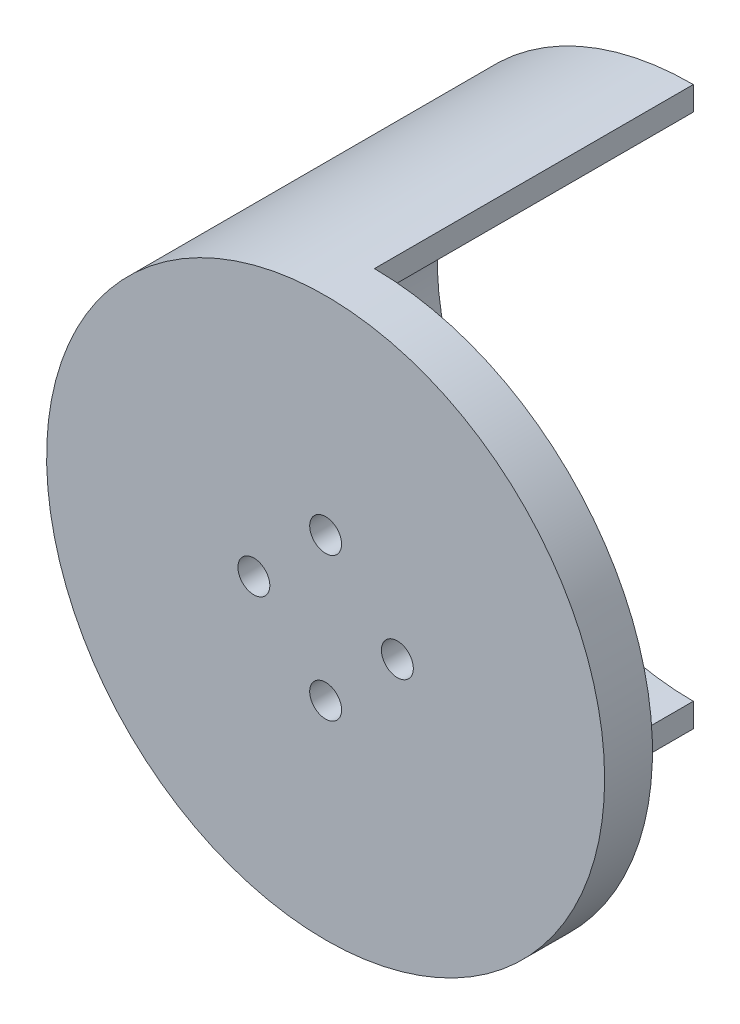
ISO-10303-21;
HEADER;
FILE_DESCRIPTION(('STEP AP214'),'2;1');
FILE_NAME('part.step','',(''),(''),'','','');
FILE_SCHEMA(('AUTOMOTIVE_DESIGN { 1 0 10303 214 1 1 1 1 }'));
ENDSEC;
DATA;
#1=APPLICATION_CONTEXT('core data for automotive mechanical design processes');
#2=APPLICATION_PROTOCOL_DEFINITION('international standard','automotive_design',2000,#1);
#3=PRODUCT_CONTEXT('',#1,'mechanical');
#4=PRODUCT('Part','Part','',(#3));
#5=PRODUCT_RELATED_PRODUCT_CATEGORY('part','',(#4));
#6=PRODUCT_DEFINITION_FORMATION('','',#4);
#7=PRODUCT_DEFINITION_CONTEXT('part definition',#1,'design');
#8=PRODUCT_DEFINITION('design','',#6,#7);
#9=PRODUCT_DEFINITION_SHAPE('','',#8);
#10=(LENGTH_UNIT() NAMED_UNIT(*) SI_UNIT(.MILLI.,.METRE.));
#11=(NAMED_UNIT(*) PLANE_ANGLE_UNIT() SI_UNIT($,.RADIAN.));
#12=(NAMED_UNIT(*) SI_UNIT($,.STERADIAN.) SOLID_ANGLE_UNIT());
#13=UNCERTAINTY_MEASURE_WITH_UNIT(LENGTH_MEASURE(1.E-05),#10,'distance_accuracy_value','');
#14=(GEOMETRIC_REPRESENTATION_CONTEXT(3) GLOBAL_UNCERTAINTY_ASSIGNED_CONTEXT((#13)) GLOBAL_UNIT_ASSIGNED_CONTEXT((#10,
#11,#12)) REPRESENTATION_CONTEXT('',''));
#15=CARTESIAN_POINT('',(0.,0.,0.));
#16=DIRECTION('',(0.,0.,1.));
#17=DIRECTION('',(1.,0.,0.));
#18=AXIS2_PLACEMENT_3D('',#15,#16,#17);
#19=CARTESIAN_POINT('',(0.,0.,-20.));
#20=DIRECTION('',(0.,0.,-1.));
#21=DIRECTION('',(1.,0.,0.));
#22=AXIS2_PLACEMENT_3D('',#19,#20,#21);
#23=PLANE('',#22);
#24=CARTESIAN_POINT('',(0.,0.,-20.));
#25=DIRECTION('',(0.,0.,1.));
#26=DIRECTION('',(1.,0.,0.));
#27=AXIS2_PLACEMENT_3D('',#24,#25,#26);
#28=CIRCLE('',#27,17.5);
#29=CARTESIAN_POINT('',(0.0613389301193247,17.4998925006885,-20.));
#30=VERTEX_POINT('',#29);
#31=CARTESIAN_POINT('',(0.0613389301193247,-17.4998925006885,-20.));
#32=VERTEX_POINT('',#31);
#33=EDGE_CURVE('E46',#30,#32,#28,.T.);
#34=ORIENTED_EDGE('',*,*,#33,.F.);
#35=DIRECTION('',(0.,1.,0.));
#36=VECTOR('',#35,1.);
#37=CARTESIAN_POINT('',(0.0613389301193247,0.,-20.));
#38=LINE('',#37,#36);
#39=CARTESIAN_POINT('',(0.0613389301193247,15.9998824225571,-20.));
#40=VERTEX_POINT('',#39);
#41=EDGE_CURVE('E146',#40,#30,#38,.T.);
#42=ORIENTED_EDGE('',*,*,#41,.F.);
#43=CARTESIAN_POINT('',(0.,0.,-20.));
#44=DIRECTION('',(0.,0.,1.));
#45=DIRECTION('',(1.,0.,0.));
#46=AXIS2_PLACEMENT_3D('',#43,#44,#45);
#47=CIRCLE('',#46,16.);
#48=CARTESIAN_POINT('',(0.0613389301193247,-15.9998824225571,-20.));
#49=VERTEX_POINT('',#48);
#50=EDGE_CURVE('E221',#40,#49,#47,.T.);
#51=ORIENTED_EDGE('',*,*,#50,.T.);
#52=EDGE_CURVE('E150',#32,#49,#38,.T.);
#53=ORIENTED_EDGE('',*,*,#52,.F.);
#54=EDGE_LOOP('',(#34,#42,#51,#53));
#55=FACE_BOUND('',#54,.T.);
#56=ADVANCED_FACE('F37',(#55),#23,.T.);
#57=CARTESIAN_POINT('',(0.,0.,-20.));
#58=DIRECTION('',(0.,0.,1.));
#59=DIRECTION('',(-1.,0.,0.));
#60=AXIS2_PLACEMENT_3D('',#57,#58,#59);
#61=CYLINDRICAL_SURFACE('',#60,17.5);
#62=DIRECTION('',(0.,0.,1.));
#63=VECTOR('',#62,1.);
#64=CARTESIAN_POINT('',(-9.79795897113271,-14.5,-20.));
#65=LINE('',#64,#63);
#66=CARTESIAN_POINT('',(-9.79795897113271,-14.5,-7.));
#67=VERTEX_POINT('',#66);
#68=CARTESIAN_POINT('',(-9.79795897113271,-14.5,0.));
#69=VERTEX_POINT('',#68);
#70=EDGE_CURVE('E127',#67,#69,#65,.T.);
#71=ORIENTED_EDGE('',*,*,#70,.F.);
#72=CARTESIAN_POINT('',(0.,0.,-7.));
#73=DIRECTION('',(0.,0.,1.));
#74=DIRECTION('',(0.,-1.,0.));
#75=AXIS2_PLACEMENT_3D('',#72,#73,#74);
#76=CIRCLE('',#75,17.5);
#77=CARTESIAN_POINT('',(-15.5643824162734,-8.,-7.));
#78=VERTEX_POINT('',#77);
#79=EDGE_CURVE('E121',#78,#67,#76,.T.);
#80=ORIENTED_EDGE('',*,*,#79,.F.);
#81=DIRECTION('',(0.,0.,1.));
#82=VECTOR('',#81,1.);
#83=CARTESIAN_POINT('',(-15.5643824162734,-8.,-20.));
#84=LINE('',#83,#82);
#85=CARTESIAN_POINT('',(-15.5643824162734,-8.,0.));
#86=VERTEX_POINT('',#85);
#87=EDGE_CURVE('E105',#86,#78,#84,.F.);
#88=ORIENTED_EDGE('',*,*,#87,.F.);
#89=CARTESIAN_POINT('',(0.,0.,0.));
#90=DIRECTION('',(0.,0.,-1.));
#91=DIRECTION('',(0.,1.,0.));
#92=AXIS2_PLACEMENT_3D('',#89,#90,#91);
#93=CIRCLE('',#92,17.5);
#94=EDGE_CURVE('E112',#69,#86,#93,.T.);
#95=ORIENTED_EDGE('',*,*,#94,.F.);
#96=EDGE_LOOP('',(#71,#80,#88,#95));
#97=FACE_BOUND('',#96,.T.);
#98=CARTESIAN_POINT('',(0.,0.,3.));
#99=DIRECTION('',(0.,0.,1.));
#100=DIRECTION('',(1.,0.,0.));
#101=AXIS2_PLACEMENT_3D('',#98,#99,#100);
#102=CIRCLE('',#101,17.5);
#103=CARTESIAN_POINT('',(17.5,0.,3.));
#104=VERTEX_POINT('',#103);
#105=EDGE_CURVE('E185',#104,#104,#102,.T.);
#106=ORIENTED_EDGE('',*,*,#105,.F.);
#107=EDGE_LOOP('',(#106));
#108=FACE_BOUND('',#107,.T.);
#109=CARTESIAN_POINT('',(-17.5,0.,-12.));
#110=CARTESIAN_POINT('',(-17.4999967323586,-0.274887255943128,-11.9999951510951));
#111=CARTESIAN_POINT('',(-17.4934604350511,-0.549824369681454,-11.9772555275597));
#112=CARTESIAN_POINT('',(-17.4680226486276,-1.09172997799247,-11.8870893247442));
#113=CARTESIAN_POINT('',(-17.4491164802521,-1.35869541707404,-11.8196458348148));
#114=CARTESIAN_POINT('',(-17.4010172837268,-1.87676075184468,-11.6424799039587));
#115=CARTESIAN_POINT('',(-17.3718386026585,-2.12788220212056,-11.5328164096201));
#116=CARTESIAN_POINT('',(-17.3062494579136,-2.60817190282318,-11.2745550213041));
#117=CARTESIAN_POINT('',(-17.2698382377007,-2.83733785294541,-11.1259530537741));
#118=CARTESIAN_POINT('',(-17.1926183656394,-3.27323611714736,-10.7899124733177));
#119=CARTESIAN_POINT('',(-17.1517260486293,-3.47930930595233,-10.6016381153618));
#120=CARTESIAN_POINT('',(-17.0706683728915,-3.85742839481088,-10.1933806421558));
#121=CARTESIAN_POINT('',(-17.0305031239854,-4.02946919269461,-9.97339278091952));
#122=CARTESIAN_POINT('',(-16.9545753718829,-4.3379947501607,-9.50251604302262));
#123=CARTESIAN_POINT('',(-16.9189175626436,-4.47369552758351,-9.25109503733746));
#124=CARTESIAN_POINT('',(-16.8572835960235,-4.7006292638497,-8.72781997062347));
#125=CARTESIAN_POINT('',(-16.8313053561473,-4.79187178889368,-8.4559703198242));
#126=CARTESIAN_POINT('',(-16.7928402048755,-4.92496082534618,-7.90691309208477));
#127=CARTESIAN_POINT('',(-16.7800244641586,-4.9680138300687,-7.63002159307529));
#128=CARTESIAN_POINT('',(-16.7683552051415,-5.00726669473215,-7.07267212888988));
#129=CARTESIAN_POINT('',(-16.769498653032,-5.00347673524998,-6.79221495189356));
#130=CARTESIAN_POINT('',(-16.7853258599179,-4.95010336906261,-6.24532847133277));
#131=CARTESIAN_POINT('',(-16.7995695662338,-4.90200814317313,-5.97873912196361));
#132=CARTESIAN_POINT('',(-16.8392837083571,-4.76378465210904,-5.45758195085061));
#133=CARTESIAN_POINT('',(-16.8647551590827,-4.67365258702332,-5.20301521818008));
#134=CARTESIAN_POINT('',(-16.9244215882327,-4.45276702845641,-4.70938438894628));
#135=CARTESIAN_POINT('',(-16.95872291023,-4.32151377932501,-4.47055731900275));
#136=CARTESIAN_POINT('',(-17.0321304219627,-4.02245947919414,-4.01780859695957));
#137=CARTESIAN_POINT('',(-17.0712376805236,-3.85465029183281,-3.80389250566084));
#138=CARTESIAN_POINT('',(-17.151656266434,-3.47975999182637,-3.39856906098605));
#139=CARTESIAN_POINT('',(-17.1929951143159,-3.27143718711355,-3.20831381008246));
#140=CARTESIAN_POINT('',(-17.2719061804519,-2.82533070596534,-2.86518499089877));
#141=CARTESIAN_POINT('',(-17.3094782034438,-2.58754550370467,-2.71231335989559));
#142=CARTESIAN_POINT('',(-17.3769132016394,-2.08730768272867,-2.44767816306506));
#143=CARTESIAN_POINT('',(-17.4067318874312,-1.82472454452503,-2.33614928298958));
#144=CARTESIAN_POINT('',(-17.4549812871891,-1.28348307491866,-2.15916527145791));
#145=CARTESIAN_POINT('',(-17.4734148714063,-1.00482881452536,-2.09369852688682));
#146=CARTESIAN_POINT('',(-17.4963718628669,-0.449165971610882,-2.01256678572638));
#147=CARTESIAN_POINT('',(-17.501331821265,-0.172403367151275,-1.99533826156744));
#148=CARTESIAN_POINT('',(-17.4980521176773,0.380066317013954,-2.00681816575261));
#149=CARTESIAN_POINT('',(-17.4898140395157,0.655773519392766,-2.03552108211481));
#150=CARTESIAN_POINT('',(-17.4613481671301,1.19254658357578,-2.13677611079064));
#151=CARTESIAN_POINT('',(-17.4413653254419,1.4537955293371,-2.20843295330849));
#152=CARTESIAN_POINT('',(-17.3916999685472,1.9605217155141,-2.39250125496168));
#153=CARTESIAN_POINT('',(-17.3620163316471,2.20599712812179,-2.50491742722334));
#154=CARTESIAN_POINT('',(-17.2952490292284,2.68010421280007,-2.77005834161282));
#155=CARTESIAN_POINT('',(-17.2580190794575,2.90825621635021,-2.92360299706335));
#156=CARTESIAN_POINT('',(-17.180448677462,3.33609632014868,-3.26563126487772));
#157=CARTESIAN_POINT('',(-17.1401075188813,3.53577792710762,-3.45412282516136));
#158=CARTESIAN_POINT('',(-17.0592154907323,3.90776607085015,-3.86802335512367));
#159=CARTESIAN_POINT('',(-17.0187009214433,4.07896356851775,-4.09443818889788));
#160=CARTESIAN_POINT('',(-16.9434723683839,4.38098829016899,-4.57365647156141));
#161=CARTESIAN_POINT('',(-16.9087581828186,4.51181691871704,-4.82645900192717));
#162=CARTESIAN_POINT('',(-16.8494662810178,4.72843635295665,-5.35022802743902));
#163=CARTESIAN_POINT('',(-16.8248350005383,4.8144658309902,-5.62108940874769));
#164=CARTESIAN_POINT('',(-16.7885614169356,4.93948625169787,-6.17427483893332));
#165=CARTESIAN_POINT('',(-16.7769151780959,4.9784914475439,-6.4565953876774));
#166=CARTESIAN_POINT('',(-16.7682925774812,5.00745060616827,-7.0132400823757));
#167=CARTESIAN_POINT('',(-16.7707790176036,4.99920069109391,-7.28746376148121));
#168=CARTESIAN_POINT('',(-16.7888649275624,4.93811777392153,-7.83043682673311));
#169=CARTESIAN_POINT('',(-16.8044639598361,4.88528625949613,-8.09918639524222));
#170=CARTESIAN_POINT('',(-16.8466744296963,4.73764922042289,-8.6209459278904));
#171=CARTESIAN_POINT('',(-16.8731719264076,4.64327729466074,-8.87408846751958));
#172=CARTESIAN_POINT('',(-16.9341825708695,4.41557373253792,-9.36114683623883));
#173=CARTESIAN_POINT('',(-16.9686971370099,4.28223520107836,-9.59505925318534));
#174=CARTESIAN_POINT('',(-17.0432917237999,3.97516366337116,-10.045458804511));
#175=CARTESIAN_POINT('',(-17.0835190794904,3.80023069306842,-10.2611034783543));
#176=CARTESIAN_POINT('',(-17.164246127292,3.41714960094825,-10.6605597395252));
#177=CARTESIAN_POINT('',(-17.2047458854255,3.20899312682136,-10.8443632977772));
#178=CARTESIAN_POINT('',(-17.282698989313,2.75893580216352,-11.1795929608164));
#179=CARTESIAN_POINT('',(-17.3200475259364,2.51630625589946,-11.330067468174));
#180=CARTESIAN_POINT('',(-17.3862848944483,2.00812632411665,-11.5878644625551));
#181=CARTESIAN_POINT('',(-17.4151783467569,1.74258856028685,-11.6952105298327));
#182=CARTESIAN_POINT('',(-17.4581836181329,1.23229078833759,-11.8521188784886));
#183=CARTESIAN_POINT('',(-17.473742109052,0.989407519060976,-11.9074338417114));
#184=CARTESIAN_POINT('',(-17.4946510963036,0.497695921965917,-11.9813741431054));
#185=CARTESIAN_POINT('',(-17.5000029583499,0.248868394040229,-12.0000043899422));
#186=CARTESIAN_POINT('',(-17.5,0.,-12.));
#187=B_SPLINE_CURVE_WITH_KNOTS('',3,(#109,#110,#111,#112,#113,#114,#115,#116,#117,#118,#119,
#120,#121,#122,#123,#124,#125,#126,#127,#128,#129,#130,#131,#132,#133,#134,#135,#136,#137,#138,
#139,#140,#141,#142,#143,#144,#145,#146,#147,#148,#149,#150,#151,#152,#153,#154,#155,#156,#157,
#158,#159,#160,#161,#162,#163,#164,#165,#166,#167,#168,#169,#170,#171,#172,#173,#174,#175,#176,
#177,#178,#179,#180,#181,#182,#183,#184,#185,#186),.UNSPECIFIED.,.T.,.F.,(4,2,2,2,2,2,2,2,2,2,2,
2,2,2,2,2,2,2,2,2,2,2,2,2,2,2,2,2,2,2,2,2,2,2,2,2,2,2,4),(0.,0.82374828135586,1.64780834948795,
2.47072203223836,3.29372183858789,4.13619528826953,4.97879494684283,5.83832688250143,
6.69767378862023,7.53498774656874,8.37211973078082,9.18211964575844,9.99219279470076,
10.8125200823279,11.6330301394812,12.4844625151101,13.3359390039338,14.1921775276588,
15.0482001004129,15.8761364425026,16.7039734359138,17.5151285120356,18.3263774144358,
19.1551881336589,19.9841875797423,20.840302622156,21.6963878741801,22.5478643342011,
23.399082644741,24.2181670405214,25.0372241048183,25.8479274074504,26.6587742501082,
27.4966914224279,28.3348195778806,29.1944494744229,30.053608731021,30.7994867011175,
31.5452648608618),.UNSPECIFIED.);
#188=CARTESIAN_POINT('',(-17.5,0.,-12.));
#189=VERTEX_POINT('',#188);
#190=EDGE_CURVE('E178',#189,#189,#187,.T.);
#191=ORIENTED_EDGE('',*,*,#190,.F.);
#192=EDGE_LOOP('',(#191));
#193=FACE_BOUND('',#192,.T.);
#194=DIRECTION('',(0.,0.,1.));
#195=VECTOR('',#194,1.);
#196=CARTESIAN_POINT('',(0.0613389301193247,-17.4998925006885,-30.));
#197=LINE('',#196,#195);
#198=CARTESIAN_POINT('',(0.0613389301193247,-17.4998925006885,0.));
#199=VERTEX_POINT('',#198);
#200=EDGE_CURVE('E138',#32,#199,#197,.T.);
#201=ORIENTED_EDGE('',*,*,#200,.T.);
#202=CARTESIAN_POINT('',(0.,0.,0.));
#203=DIRECTION('',(0.,0.,1.));
#204=DIRECTION('',(1.,0.,0.));
#205=AXIS2_PLACEMENT_3D('',#202,#203,#204);
#206=CIRCLE('',#205,17.5);
#207=CARTESIAN_POINT('',(0.0613389301193247,17.4998925006885,0.));
#208=VERTEX_POINT('',#207);
#209=EDGE_CURVE('E141',#199,#208,#206,.T.);
#210=ORIENTED_EDGE('',*,*,#209,.T.);
#211=DIRECTION('',(0.,0.,1.));
#212=VECTOR('',#211,1.);
#213=CARTESIAN_POINT('',(0.0613389301193247,17.4998925006885,-30.));
#214=LINE('',#213,#212);
#215=EDGE_CURVE('E135',#30,#208,#214,.T.);
#216=ORIENTED_EDGE('',*,*,#215,.F.);
#217=ORIENTED_EDGE('',*,*,#33,.T.);
#218=EDGE_LOOP('',(#201,#210,#216,#217));
#219=FACE_BOUND('',#218,.T.);
#220=ADVANCED_FACE('F39',(#97,#108,#193,#219),#61,.T.);
#221=CARTESIAN_POINT('',(0.,0.,-20.));
#222=DIRECTION('',(0.,0.,1.));
#223=DIRECTION('',(-1.,0.,0.));
#224=AXIS2_PLACEMENT_3D('',#221,#222,#223);
#225=CYLINDRICAL_SURFACE('',#224,16.);
#226=DIRECTION('',(0.,0.,1.));
#227=VECTOR('',#226,1.);
#228=CARTESIAN_POINT('',(-6.76387462923433,-14.5,-20.));
#229=LINE('',#228,#227);
#230=CARTESIAN_POINT('',(-6.76387462923433,-14.5,-7.));
#231=VERTEX_POINT('',#230);
#232=CARTESIAN_POINT('',(-6.76387462923433,-14.5,0.));
#233=VERTEX_POINT('',#232);
#234=EDGE_CURVE('E124',#231,#233,#229,.T.);
#235=ORIENTED_EDGE('',*,*,#234,.T.);
#236=CARTESIAN_POINT('',(0.,0.,0.));
#237=DIRECTION('',(0.,0.,1.));
#238=DIRECTION('',(1.,0.,0.));
#239=AXIS2_PLACEMENT_3D('',#236,#237,#238);
#240=CIRCLE('',#239,16.);
#241=CARTESIAN_POINT('',(0.0613389301193247,-15.9998824225571,0.));
#242=VERTEX_POINT('',#241);
#243=EDGE_CURVE('E224',#233,#242,#240,.T.);
#244=ORIENTED_EDGE('',*,*,#243,.T.);
#245=DIRECTION('',(0.,0.,1.));
#246=VECTOR('',#245,1.);
#247=CARTESIAN_POINT('',(0.0613389301193247,-15.9998824225571,-20.));
#248=LINE('',#247,#246);
#249=EDGE_CURVE('E149',#49,#242,#248,.T.);
#250=ORIENTED_EDGE('',*,*,#249,.F.);
#251=ORIENTED_EDGE('',*,*,#50,.F.);
#252=DIRECTION('',(0.,0.,1.));
#253=VECTOR('',#252,1.);
#254=CARTESIAN_POINT('',(0.0613389301193247,15.9998824225571,-20.));
#255=LINE('',#254,#253);
#256=CARTESIAN_POINT('',(0.0613389301193247,15.9998824225571,0.));
#257=VERTEX_POINT('',#256);
#258=EDGE_CURVE('E144',#257,#40,#255,.F.);
#259=ORIENTED_EDGE('',*,*,#258,.F.);
#260=CARTESIAN_POINT('',(-13.856406460551,-8.,0.));
#261=VERTEX_POINT('',#260);
#262=EDGE_CURVE('E222',#257,#261,#240,.T.);
#263=ORIENTED_EDGE('',*,*,#262,.T.);
#264=DIRECTION('',(0.,0.,1.));
#265=VECTOR('',#264,1.);
#266=CARTESIAN_POINT('',(-13.856406460551,-8.,-20.));
#267=LINE('',#266,#265);
#268=CARTESIAN_POINT('',(-13.856406460551,-8.,-7.));
#269=VERTEX_POINT('',#268);
#270=EDGE_CURVE('E108',#261,#269,#267,.F.);
#271=ORIENTED_EDGE('',*,*,#270,.T.);
#272=CARTESIAN_POINT('',(0.,0.,-7.));
#273=DIRECTION('',(0.,0.,1.));
#274=DIRECTION('',(0.,-1.,0.));
#275=AXIS2_PLACEMENT_3D('',#272,#273,#274);
#276=CIRCLE('',#275,16.);
#277=EDGE_CURVE('E11',#269,#231,#276,.T.);
#278=ORIENTED_EDGE('',*,*,#277,.T.);
#279=EDGE_LOOP('',(#235,#244,#250,#251,#259,#263,#271,#278));
#280=FACE_BOUND('',#279,.T.);
#281=CARTESIAN_POINT('',(-16.,0.,-12.));
#282=CARTESIAN_POINT('',(-15.9999986351195,-0.273756740698179,-11.9999982136497));
#283=CARTESIAN_POINT('',(-15.9929077993933,-0.54753221001141,-11.9774430922222));
#284=CARTESIAN_POINT('',(-15.9653157635526,-1.08707683835382,-11.888055033843));
#285=CARTESIAN_POINT('',(-15.9448115279957,-1.35284417090373,-11.8212120745424));
#286=CARTESIAN_POINT('',(-15.892632627915,-1.86851417460312,-11.6457225152172));
#287=CARTESIAN_POINT('',(-15.860975259956,-2.11844070794284,-11.5371406213887));
#288=CARTESIAN_POINT('',(-15.7897587664487,-2.59653920938621,-11.2815307292862));
#289=CARTESIAN_POINT('',(-15.7501983960149,-2.82470774178094,-11.1344966728757));
#290=CARTESIAN_POINT('',(-15.6660085495921,-3.25986133980768,-10.8013760319326));
#291=CARTESIAN_POINT('',(-15.621268637007,-3.46608011262119,-10.6143164597633));
#292=CARTESIAN_POINT('',(-15.5324018550409,-3.84478952815342,-10.2085264303382));
#293=CARTESIAN_POINT('',(-15.4882751012093,-4.01727389161514,-9.98979008999343));
#294=CARTESIAN_POINT('',(-15.4044457876484,-4.32777345930637,-9.52022174479268));
#295=CARTESIAN_POINT('',(-15.3648795310221,-4.46483136593109,-9.2687300899923));
#296=CARTESIAN_POINT('',(-15.2963120709366,-4.69438964299238,-8.74483074017737));
#297=CARTESIAN_POINT('',(-15.2673080849026,-4.78690175085853,-8.47242857685659));
#298=CARTESIAN_POINT('',(-15.224304279618,-4.92193839721856,-7.92308769016631));
#299=CARTESIAN_POINT('',(-15.2098789171452,-4.96588440031618,-7.64653262543181));
#300=CARTESIAN_POINT('',(-15.1964022056731,-5.00698220147793,-7.0896275243652));
#301=CARTESIAN_POINT('',(-15.1973467694717,-5.00414643984172,-6.80927851673902));
#302=CARTESIAN_POINT('',(-15.2141275626545,-4.95287298929817,-6.26450215888892));
#303=CARTESIAN_POINT('',(-15.2293736684469,-4.90624231472934,-5.99988349644806));
#304=CARTESIAN_POINT('',(-15.272081024701,-4.77163253417961,-5.48243137375097));
#305=CARTESIAN_POINT('',(-15.2995435733467,-4.68364903377187,-5.2295991691417));
#306=CARTESIAN_POINT('',(-15.3640417609541,-4.46755498726522,-4.73859222230161));
#307=CARTESIAN_POINT('',(-15.4012113865356,-4.33887702648707,-4.5006855572407));
#308=CARTESIAN_POINT('',(-15.4808742631002,-4.04544082951013,-4.04924892847488));
#309=CARTESIAN_POINT('',(-15.523368895754,-3.88067322086205,-3.83572531898279));
#310=CARTESIAN_POINT('',(-15.6112611120491,-3.51086781672958,-3.42890022633452));
#311=CARTESIAN_POINT('',(-15.6567027842357,-3.30433828237156,-3.23696176888193));
#312=CARTESIAN_POINT('',(-15.7436628303753,-2.86145763238183,-2.89011242568063));
#313=CARTESIAN_POINT('',(-15.7851809135328,-2.62510430939601,-2.73520428312299));
#314=CARTESIAN_POINT('',(-15.8600517956098,-2.1266584418619,-2.46588924559508));
#315=CARTESIAN_POINT('',(-15.8933384259289,-1.86437962767714,-2.35180745814418));
#316=CARTESIAN_POINT('',(-15.9475182331416,-1.32307191113056,-2.16978799659369));
#317=CARTESIAN_POINT('',(-15.9684151730059,-1.04404812289843,-2.10183631104641));
#318=CARTESIAN_POINT('',(-15.9948555758007,-0.488740629161386,-2.0163278296841));
#319=CARTESIAN_POINT('',(-16.0009609158175,-0.212767395155375,-1.99692582562591));
#320=CARTESIAN_POINT('',(-15.9987919892393,0.338521222930343,-2.00386490654933));
#321=CARTESIAN_POINT('',(-15.9905198232454,0.613836697226034,-2.03019930929045));
#322=CARTESIAN_POINT('',(-15.9608945507905,1.14887733190339,-2.12638237042555));
#323=CARTESIAN_POINT('',(-15.9398717244275,1.40881991368375,-2.19513307044995));
#324=CARTESIAN_POINT('',(-15.8872048551716,1.91340771544551,-2.37285740946687));
#325=CARTESIAN_POINT('',(-15.8555595005737,2.15805104179623,-2.48183601610005));
#326=CARTESIAN_POINT('',(-15.783941710377,2.63172962668875,-2.73989286619475));
#327=CARTESIAN_POINT('',(-15.7437850727067,2.86023895915116,-2.88988394998725));
#328=CARTESIAN_POINT('',(-15.6597364001372,3.28946340384104,-3.2246128404697));
#329=CARTESIAN_POINT('',(-15.6158433539155,3.4901709521758,-3.40936007097857));
#330=CARTESIAN_POINT('',(-15.5270797953257,3.86634985167607,-3.8170355602084));
#331=CARTESIAN_POINT('',(-15.4822394682577,4.04050609358125,-4.0411866549569));
#332=CARTESIAN_POINT('',(-15.3984778838242,4.34885000980606,-4.5165064655071));
#333=CARTESIAN_POINT('',(-15.3595565324524,4.48303831893718,-4.76767475210794));
#334=CARTESIAN_POINT('',(-15.2924712932348,4.70680333922169,-5.28938069148191));
#335=CARTESIAN_POINT('',(-15.264265854275,4.7965527822405,-5.55983859774289));
#336=CARTESIAN_POINT('',(-15.2220468337724,4.9289157727236,-6.11308997299448));
#337=CARTESIAN_POINT('',(-15.2080278520491,4.97154725655978,-6.39587870537413));
#338=CARTESIAN_POINT('',(-15.1963317085551,5.00717624632502,-6.95201635032171));
#339=CARTESIAN_POINT('',(-15.1979441840057,5.00233118486543,-7.22521381538967));
#340=CARTESIAN_POINT('',(-15.2156036150361,4.94835272515335,-7.76669833976775));
#341=CARTESIAN_POINT('',(-15.2316498972642,4.89922139290048,-8.03498562754694));
#342=CARTESIAN_POINT('',(-15.2758725673356,4.7595091965447,-8.55517615836757));
#343=CARTESIAN_POINT('',(-15.3038679276103,4.66954569624033,-8.80726176437344));
#344=CARTESIAN_POINT('',(-15.3687881701826,4.45120909339998,-9.29296165413602));
#345=CARTESIAN_POINT('',(-15.4057148685869,4.32282817776947,-9.52657216831362));
#346=CARTESIAN_POINT('',(-15.4861394813401,4.02542700053973,-9.97858388175925));
#347=CARTESIAN_POINT('',(-15.5298379569183,3.85501334096529,-10.196032518001));
#348=CARTESIAN_POINT('',(-15.6179599528484,3.4808359856192,-10.599945312448));
#349=CARTESIAN_POINT('',(-15.6623836642662,3.27706336937756,-10.7864011559642));
#350=CARTESIAN_POINT('',(-15.7486908780989,2.83394665129338,-11.1291301534517));
#351=CARTESIAN_POINT('',(-15.7904440692269,2.59365829794953,-11.2842189457998));
#352=CARTESIAN_POINT('',(-15.8650707718751,2.0891165520546,-11.5515956605578));
#353=CARTESIAN_POINT('',(-15.8979477726329,1.82487263118179,-11.6639004085673));
#354=CARTESIAN_POINT('',(-15.9488260293388,1.30299054149591,-11.8343654704339));
#355=CARTESIAN_POINT('',(-15.9678496322456,1.04668134845019,-11.8962994692214));
#356=CARTESIAN_POINT('',(-15.9934360136194,0.526919581760988,-11.9791134398709));
#357=CARTESIAN_POINT('',(-16.0000013135858,0.263468464558692,-12.000001719216));
#358=CARTESIAN_POINT('',(-16.,0.,-12.));
#359=B_SPLINE_CURVE_WITH_KNOTS('',3,(#281,#282,#283,#284,#285,#286,#287,#288,#289,#290,#291,
#292,#293,#294,#295,#296,#297,#298,#299,#300,#301,#302,#303,#304,#305,#306,#307,#308,#309,#310,
#311,#312,#313,#314,#315,#316,#317,#318,#319,#320,#321,#322,#323,#324,#325,#326,#327,#328,#329,
#330,#331,#332,#333,#334,#335,#336,#337,#338,#339,#340,#341,#342,#343,#344,#345,#346,#347,#348,
#349,#350,#351,#352,#353,#354,#355,#356,#357,#358),.UNSPECIFIED.,.T.,.F.,(4,2,2,2,2,2,2,2,2,2,2,
2,2,2,2,2,2,2,2,2,2,2,2,2,2,2,2,2,2,2,2,2,2,2,2,2,2,2,4),(0.,0.820301797730039,1.64078929339626,
2.46000991680974,3.27935968623356,4.12151288780633,4.96382269725105,5.82695084991452,
6.68985145121463,7.52676600672195,8.36345801183908,9.16707669695194,9.97078079925601,
10.7862257089153,11.6018826405078,12.4546698912775,13.3075202966256,14.1670184276843,
15.0262553798756,15.852302742023,16.678229426068,17.4836250690084,18.2891202014735,
19.1142529896272,19.9396098284639,20.7976711486191,21.655718839442,22.5104046302277,
23.3647649559871,24.1804881394266,24.9961732705188,25.7999165363422,26.6038233736823,
27.4391805607299,28.274761495409,29.1376267255319,30.0001522671289,30.789785466537,
31.5792588309973),.UNSPECIFIED.);
#360=CARTESIAN_POINT('',(-16.,0.,-12.));
#361=VERTEX_POINT('',#360);
#362=EDGE_CURVE('E177',#361,#361,#359,.T.);
#363=ORIENTED_EDGE('',*,*,#362,.T.);
#364=EDGE_LOOP('',(#363));
#365=FACE_BOUND('',#364,.T.);
#366=ADVANCED_FACE('F205',(#280,#365),#225,.F.);
#367=CARTESIAN_POINT('',(0.,0.,0.));
#368=DIRECTION('',(0.,0.,-1.));
#369=DIRECTION('',(1.,0.,0.));
#370=AXIS2_PLACEMENT_3D('',#367,#368,#369);
#371=PLANE('',#370);
#372=ORIENTED_EDGE('',*,*,#262,.F.);
#373=DIRECTION('',(0.,-1.,0.));
#374=VECTOR('',#373,1.);
#375=CARTESIAN_POINT('',(0.0613389301193247,-17.4998925006885,0.));
#376=LINE('',#375,#374);
#377=EDGE_CURVE('E133',#208,#257,#376,.T.);
#378=ORIENTED_EDGE('',*,*,#377,.F.);
#379=ORIENTED_EDGE('',*,*,#209,.F.);
#380=EDGE_CURVE('E120',#242,#199,#376,.T.);
#381=ORIENTED_EDGE('',*,*,#380,.F.);
#382=ORIENTED_EDGE('',*,*,#243,.F.);
#383=DIRECTION('',(1.,0.,0.));
#384=VECTOR('',#383,1.);
#385=CARTESIAN_POINT('',(-30.,-14.5,0.));
#386=LINE('',#385,#384);
#387=EDGE_CURVE('E116',#69,#233,#386,.T.);
#388=ORIENTED_EDGE('',*,*,#387,.F.);
#389=ORIENTED_EDGE('',*,*,#94,.T.);
#390=DIRECTION('',(1.,0.,0.));
#391=VECTOR('',#390,1.);
#392=CARTESIAN_POINT('',(-30.,-8.,0.));
#393=LINE('',#392,#391);
#394=EDGE_CURVE('E61',#86,#261,#393,.T.);
#395=ORIENTED_EDGE('',*,*,#394,.T.);
#396=EDGE_LOOP('',(#372,#378,#379,#381,#382,#388,#389,#395));
#397=FACE_BOUND('',#396,.T.);
#398=CARTESIAN_POINT('',(0.,-4.5,0.));
#399=DIRECTION('',(0.,0.,1.));
#400=DIRECTION('',(1.,0.,0.));
#401=AXIS2_PLACEMENT_3D('',#398,#399,#400);
#402=CIRCLE('',#401,1.);
#403=CARTESIAN_POINT('',(1.00000000000005,-4.5,0.));
#404=VERTEX_POINT('',#403);
#405=EDGE_CURVE('E156',#404,#404,#402,.T.);
#406=ORIENTED_EDGE('',*,*,#405,.T.);
#407=EDGE_LOOP('',(#406));
#408=FACE_BOUND('',#407,.T.);
#409=CARTESIAN_POINT('',(0.,4.5,0.));
#410=DIRECTION('',(0.,0.,1.));
#411=DIRECTION('',(1.,0.,0.));
#412=AXIS2_PLACEMENT_3D('',#409,#410,#411);
#413=CIRCLE('',#412,1.);
#414=CARTESIAN_POINT('',(0.999999999999985,4.5,0.));
#415=VERTEX_POINT('',#414);
#416=EDGE_CURVE('E171',#415,#415,#413,.T.);
#417=ORIENTED_EDGE('',*,*,#416,.T.);
#418=EDGE_LOOP('',(#417));
#419=FACE_BOUND('',#418,.T.);
#420=CARTESIAN_POINT('',(4.5,0.,0.));
#421=DIRECTION('',(0.,0.,1.));
#422=DIRECTION('',(1.,0.,0.));
#423=AXIS2_PLACEMENT_3D('',#420,#421,#422);
#424=CIRCLE('',#423,1.);
#425=CARTESIAN_POINT('',(5.5,0.,0.));
#426=VERTEX_POINT('',#425);
#427=EDGE_CURVE('E174',#426,#426,#424,.T.);
#428=ORIENTED_EDGE('',*,*,#427,.T.);
#429=EDGE_LOOP('',(#428));
#430=FACE_BOUND('',#429,.T.);
#431=CARTESIAN_POINT('',(-4.5,0.,0.));
#432=DIRECTION('',(0.,0.,1.));
#433=DIRECTION('',(1.,0.,0.));
#434=AXIS2_PLACEMENT_3D('',#431,#432,#433);
#435=CIRCLE('',#434,1.);
#436=CARTESIAN_POINT('',(-3.5,0.,0.));
#437=VERTEX_POINT('',#436);
#438=EDGE_CURVE('E168',#437,#437,#435,.T.);
#439=ORIENTED_EDGE('',*,*,#438,.T.);
#440=EDGE_LOOP('',(#439));
#441=FACE_BOUND('',#440,.T.);
#442=ADVANCED_FACE('F113',(#397,#408,#419,#430,#441),#371,.T.);
#443=CARTESIAN_POINT('',(0.,0.,3.));
#444=DIRECTION('',(0.,0.,-1.));
#445=DIRECTION('',(1.,0.,0.));
#446=AXIS2_PLACEMENT_3D('',#443,#444,#445);
#447=PLANE('',#446);
#448=CARTESIAN_POINT('',(4.5,0.,3.));
#449=DIRECTION('',(0.,0.,-1.));
#450=DIRECTION('',(-1.,0.,0.));
#451=AXIS2_PLACEMENT_3D('',#448,#449,#450);
#452=CIRCLE('',#451,1.);
#453=CARTESIAN_POINT('',(3.5,0.,3.));
#454=VERTEX_POINT('',#453);
#455=EDGE_CURVE('E153',#454,#454,#452,.T.);
#456=ORIENTED_EDGE('',*,*,#455,.T.);
#457=EDGE_LOOP('',(#456));
#458=FACE_BOUND('',#457,.T.);
#459=CARTESIAN_POINT('',(0.,4.5,3.));
#460=DIRECTION('',(0.,0.,-1.));
#461=DIRECTION('',(-1.,0.,0.));
#462=AXIS2_PLACEMENT_3D('',#459,#460,#461);
#463=CIRCLE('',#462,1.);
#464=CARTESIAN_POINT('',(-1.00000000000002,4.5,3.));
#465=VERTEX_POINT('',#464);
#466=EDGE_CURVE('E157',#465,#465,#463,.T.);
#467=ORIENTED_EDGE('',*,*,#466,.T.);
#468=EDGE_LOOP('',(#467));
#469=FACE_BOUND('',#468,.T.);
#470=CARTESIAN_POINT('',(-4.5,0.,3.));
#471=DIRECTION('',(0.,0.,-1.));
#472=DIRECTION('',(-1.,0.,0.));
#473=AXIS2_PLACEMENT_3D('',#470,#471,#472);
#474=CIRCLE('',#473,1.);
#475=CARTESIAN_POINT('',(-5.5,0.,3.));
#476=VERTEX_POINT('',#475);
#477=EDGE_CURVE('E160',#476,#476,#474,.T.);
#478=ORIENTED_EDGE('',*,*,#477,.T.);
#479=EDGE_LOOP('',(#478));
#480=FACE_BOUND('',#479,.T.);
#481=CARTESIAN_POINT('',(0.,-4.5,3.));
#482=DIRECTION('',(0.,0.,-1.));
#483=DIRECTION('',(-1.,0.,0.));
#484=AXIS2_PLACEMENT_3D('',#481,#482,#483);
#485=CIRCLE('',#484,1.);
#486=CARTESIAN_POINT('',(-0.999999999999954,-4.5,3.));
#487=VERTEX_POINT('',#486);
#488=EDGE_CURVE('E163',#487,#487,#485,.T.);
#489=ORIENTED_EDGE('',*,*,#488,.T.);
#490=EDGE_LOOP('',(#489));
#491=FACE_BOUND('',#490,.T.);
#492=ORIENTED_EDGE('',*,*,#105,.T.);
#493=EDGE_LOOP('',(#492));
#494=FACE_BOUND('',#493,.T.);
#495=ADVANCED_FACE('F193',(#458,#469,#480,#491,#494),#447,.F.);
#496=CARTESIAN_POINT('',(-40.,0.,-7.));
#497=DIRECTION('',(1.,0.,0.));
#498=DIRECTION('',(0.,0.,1.));
#499=AXIS2_PLACEMENT_3D('',#496,#497,#498);
#500=CYLINDRICAL_SURFACE('',#499,5.);
#501=ORIENTED_EDGE('',*,*,#362,.F.);
#502=EDGE_LOOP('',(#501));
#503=FACE_BOUND('',#502,.T.);
#504=ORIENTED_EDGE('',*,*,#190,.T.);
#505=EDGE_LOOP('',(#504));
#506=FACE_BOUND('',#505,.T.);
#507=ADVANCED_FACE('F187',(#503,#506),#500,.F.);
#508=CARTESIAN_POINT('',(0.,-4.5,-7.));
#509=DIRECTION('',(0.,0.,1.));
#510=DIRECTION('',(-1.,0.,0.));
#511=AXIS2_PLACEMENT_3D('',#508,#509,#510);
#512=CYLINDRICAL_SURFACE('',#511,1.);
#513=ORIENTED_EDGE('',*,*,#405,.F.);
#514=EDGE_LOOP('',(#513));
#515=FACE_BOUND('',#514,.T.);
#516=ORIENTED_EDGE('',*,*,#488,.F.);
#517=EDGE_LOOP('',(#516));
#518=FACE_BOUND('',#517,.T.);
#519=ADVANCED_FACE('F192',(#515,#518),#512,.F.);
#520=CARTESIAN_POINT('',(-4.5,0.,-7.));
#521=DIRECTION('',(0.,0.,1.));
#522=DIRECTION('',(-1.,0.,0.));
#523=AXIS2_PLACEMENT_3D('',#520,#521,#522);
#524=CYLINDRICAL_SURFACE('',#523,1.);
#525=ORIENTED_EDGE('',*,*,#438,.F.);
#526=EDGE_LOOP('',(#525));
#527=FACE_BOUND('',#526,.T.);
#528=ORIENTED_EDGE('',*,*,#477,.F.);
#529=EDGE_LOOP('',(#528));
#530=FACE_BOUND('',#529,.T.);
#531=ADVANCED_FACE('F265',(#527,#530),#524,.F.);
#532=CARTESIAN_POINT('',(0.,4.5,-7.));
#533=DIRECTION('',(0.,0.,1.));
#534=DIRECTION('',(-1.,0.,0.));
#535=AXIS2_PLACEMENT_3D('',#532,#533,#534);
#536=CYLINDRICAL_SURFACE('',#535,1.);
#537=ORIENTED_EDGE('',*,*,#416,.F.);
#538=EDGE_LOOP('',(#537));
#539=FACE_BOUND('',#538,.T.);
#540=ORIENTED_EDGE('',*,*,#466,.F.);
#541=EDGE_LOOP('',(#540));
#542=FACE_BOUND('',#541,.T.);
#543=ADVANCED_FACE('F262',(#539,#542),#536,.F.);
#544=CARTESIAN_POINT('',(4.5,0.,-7.));
#545=DIRECTION('',(0.,0.,1.));
#546=DIRECTION('',(-1.,0.,0.));
#547=AXIS2_PLACEMENT_3D('',#544,#545,#546);
#548=CYLINDRICAL_SURFACE('',#547,1.);
#549=ORIENTED_EDGE('',*,*,#427,.F.);
#550=EDGE_LOOP('',(#549));
#551=FACE_BOUND('',#550,.T.);
#552=ORIENTED_EDGE('',*,*,#455,.F.);
#553=EDGE_LOOP('',(#552));
#554=FACE_BOUND('',#553,.T.);
#555=ADVANCED_FACE('F259',(#551,#554),#548,.F.);
#556=CARTESIAN_POINT('',(0.0613389301193247,-17.4998925006885,-30.));
#557=DIRECTION('',(1.,0.,0.));
#558=DIRECTION('',(0.,0.,1.));
#559=AXIS2_PLACEMENT_3D('',#556,#557,#558);
#560=PLANE('',#559);
#561=ORIENTED_EDGE('',*,*,#200,.F.);
#562=ORIENTED_EDGE('',*,*,#52,.T.);
#563=ORIENTED_EDGE('',*,*,#249,.T.);
#564=ORIENTED_EDGE('',*,*,#380,.T.);
#565=EDGE_LOOP('',(#561,#562,#563,#564));
#566=FACE_BOUND('',#565,.T.);
#567=ADVANCED_FACE('F234',(#566),#560,.T.);
#568=ORIENTED_EDGE('',*,*,#258,.T.);
#569=ORIENTED_EDGE('',*,*,#41,.T.);
#570=ORIENTED_EDGE('',*,*,#215,.T.);
#571=ORIENTED_EDGE('',*,*,#377,.T.);
#572=EDGE_LOOP('',(#568,#569,#570,#571));
#573=FACE_BOUND('',#572,.T.);
#574=ADVANCED_FACE('F236',(#573),#560,.T.);
#575=CARTESIAN_POINT('',(-30.,-8.,-7.));
#576=DIRECTION('',(0.,0.,-1.));
#577=DIRECTION('',(0.,-1.,0.));
#578=AXIS2_PLACEMENT_3D('',#575,#576,#577);
#579=PLANE('',#578);
#580=DIRECTION('',(1.,0.,0.));
#581=VECTOR('',#580,1.);
#582=CARTESIAN_POINT('',(-30.,-8.,-7.));
#583=LINE('',#582,#581);
#584=EDGE_CURVE('E53',#78,#269,#583,.T.);
#585=ORIENTED_EDGE('',*,*,#584,.F.);
#586=ORIENTED_EDGE('',*,*,#79,.T.);
#587=DIRECTION('',(1.,0.,0.));
#588=VECTOR('',#587,1.);
#589=CARTESIAN_POINT('',(-30.,-14.5,-7.));
#590=LINE('',#589,#588);
#591=EDGE_CURVE('E243',#67,#231,#590,.T.);
#592=ORIENTED_EDGE('',*,*,#591,.T.);
#593=ORIENTED_EDGE('',*,*,#277,.F.);
#594=EDGE_LOOP('',(#585,#586,#592,#593));
#595=FACE_BOUND('',#594,.T.);
#596=ADVANCED_FACE('F247',(#595),#579,.F.);
#597=CARTESIAN_POINT('',(-30.,-14.5,0.));
#598=DIRECTION('',(0.,-1.,0.));
#599=DIRECTION('',(0.,0.,1.));
#600=AXIS2_PLACEMENT_3D('',#597,#598,#599);
#601=PLANE('',#600);
#602=ORIENTED_EDGE('',*,*,#591,.F.);
#603=ORIENTED_EDGE('',*,*,#70,.T.);
#604=ORIENTED_EDGE('',*,*,#387,.T.);
#605=ORIENTED_EDGE('',*,*,#234,.F.);
#606=EDGE_LOOP('',(#602,#603,#604,#605));
#607=FACE_BOUND('',#606,.T.);
#608=ADVANCED_FACE('F242',(#607),#601,.F.);
#609=CARTESIAN_POINT('',(-30.,-8.,0.));
#610=DIRECTION('',(0.,1.,0.));
#611=DIRECTION('',(0.,0.,-1.));
#612=AXIS2_PLACEMENT_3D('',#609,#610,#611);
#613=PLANE('',#612);
#614=ORIENTED_EDGE('',*,*,#394,.F.);
#615=ORIENTED_EDGE('',*,*,#87,.T.);
#616=ORIENTED_EDGE('',*,*,#584,.T.);
#617=ORIENTED_EDGE('',*,*,#270,.F.);
#618=EDGE_LOOP('',(#614,#615,#616,#617));
#619=FACE_BOUND('',#618,.T.);
#620=ADVANCED_FACE('F103',(#619),#613,.F.);
#621=CLOSED_SHELL('',(#56,#220,#366,#442,#495,#507,#519,#531,#543,#555,#567,#574,#596,#608,#620));
#622=MANIFOLD_SOLID_BREP('B2',#621);
#623=ADVANCED_BREP_SHAPE_REPRESENTATION('',(#18,#622),#14);
#624=SHAPE_DEFINITION_REPRESENTATION(#9,#623);
ENDSEC;
END-ISO-10303-21;
